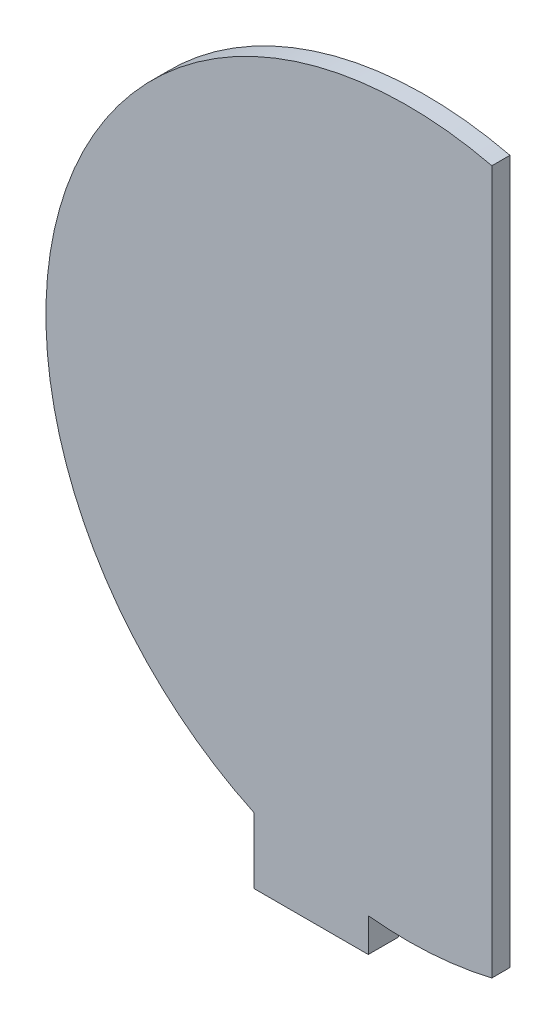
ISO-10303-21;
HEADER;
FILE_DESCRIPTION(('STEP AP214'),'2;1');
FILE_NAME('part.step','',(''),(''),'','','');
FILE_SCHEMA(('AUTOMOTIVE_DESIGN { 1 0 10303 214 1 1 1 1 }'));
ENDSEC;
DATA;
#1=APPLICATION_CONTEXT('core data for automotive mechanical design processes');
#2=APPLICATION_PROTOCOL_DEFINITION('international standard','automotive_design',2000,#1);
#3=PRODUCT_CONTEXT('',#1,'mechanical');
#4=PRODUCT('Part','Part','',(#3));
#5=PRODUCT_RELATED_PRODUCT_CATEGORY('part','',(#4));
#6=PRODUCT_DEFINITION_FORMATION('','',#4);
#7=PRODUCT_DEFINITION_CONTEXT('part definition',#1,'design');
#8=PRODUCT_DEFINITION('design','',#6,#7);
#9=PRODUCT_DEFINITION_SHAPE('','',#8);
#10=(LENGTH_UNIT() NAMED_UNIT(*) SI_UNIT(.MILLI.,.METRE.));
#11=(NAMED_UNIT(*) PLANE_ANGLE_UNIT() SI_UNIT($,.RADIAN.));
#12=(NAMED_UNIT(*) SI_UNIT($,.STERADIAN.) SOLID_ANGLE_UNIT());
#13=UNCERTAINTY_MEASURE_WITH_UNIT(LENGTH_MEASURE(1.E-05),#10,'distance_accuracy_value','');
#14=(GEOMETRIC_REPRESENTATION_CONTEXT(3) GLOBAL_UNCERTAINTY_ASSIGNED_CONTEXT((#13)) GLOBAL_UNIT_ASSIGNED_CONTEXT((#10,
#11,#12)) REPRESENTATION_CONTEXT('',''));
#15=CARTESIAN_POINT('',(0.,0.,0.));
#16=DIRECTION('',(0.,0.,1.));
#17=DIRECTION('',(1.,0.,0.));
#18=AXIS2_PLACEMENT_3D('',#15,#16,#17);
#19=CARTESIAN_POINT('',(-2.56182587296405,15.1062106918239,3.));
#20=DIRECTION('',(0.,0.,-1.));
#21=DIRECTION('',(-1.,0.,0.));
#22=AXIS2_PLACEMENT_3D('',#19,#20,#21);
#23=CYLINDRICAL_SURFACE('',#22,60.);
#24=CARTESIAN_POINT('',(-2.56182587296405,15.1062106918239,0.));
#25=DIRECTION('',(0.,0.,1.));
#26=DIRECTION('',(1.,0.,0.));
#27=AXIS2_PLACEMENT_3D('',#24,#25,#26);
#28=CIRCLE('',#27,60.);
#29=CARTESIAN_POINT('',(11.4193016972997,73.4545446171727,0.));
#30=VERTEX_POINT('',#29);
#31=CARTESIAN_POINT('',(-28.0806983027003,-39.1965254263023,0.));
#32=VERTEX_POINT('',#31);
#33=EDGE_CURVE('E85',#30,#32,#28,.T.);
#34=ORIENTED_EDGE('',*,*,#33,.T.);
#35=DIRECTION('',(0.,0.,-1.));
#36=VECTOR('',#35,1.);
#37=CARTESIAN_POINT('',(-28.0806983027003,-39.1965254263023,3.));
#38=LINE('',#37,#36);
#39=CARTESIAN_POINT('',(-28.0806983027003,-39.1965254263023,3.));
#40=VERTEX_POINT('',#39);
#41=EDGE_CURVE('E97',#32,#40,#38,.F.);
#42=ORIENTED_EDGE('',*,*,#41,.T.);
#43=CARTESIAN_POINT('',(-2.56182587296405,15.1062106918239,3.));
#44=DIRECTION('',(0.,0.,1.));
#45=DIRECTION('',(1.,0.,0.));
#46=AXIS2_PLACEMENT_3D('',#43,#44,#45);
#47=CIRCLE('',#46,60.);
#48=CARTESIAN_POINT('',(11.4193016972997,73.4545446171727,3.));
#49=VERTEX_POINT('',#48);
#50=EDGE_CURVE('E90',#49,#40,#47,.T.);
#51=ORIENTED_EDGE('',*,*,#50,.F.);
#52=DIRECTION('',(0.,0.,-1.));
#53=VECTOR('',#52,1.);
#54=CARTESIAN_POINT('',(11.4193016972997,73.4545446171727,3.));
#55=LINE('',#54,#53);
#56=EDGE_CURVE('E77',#49,#30,#55,.T.);
#57=ORIENTED_EDGE('',*,*,#56,.T.);
#58=EDGE_LOOP('',(#34,#42,#51,#57));
#59=FACE_BOUND('',#58,.T.);
#60=ADVANCED_FACE('F37',(#59),#23,.T.);
#61=CARTESIAN_POINT('',(-9.08069830270029,-44.538607207511,3.));
#62=VERTEX_POINT('',#61);
#63=CARTESIAN_POINT('',(11.4193016972997,-43.2421232335249,3.));
#64=VERTEX_POINT('',#63);
#65=EDGE_CURVE('E84',#62,#64,#47,.T.);
#66=ORIENTED_EDGE('',*,*,#65,.F.);
#67=DIRECTION('',(0.,0.,-1.));
#68=VECTOR('',#67,1.);
#69=CARTESIAN_POINT('',(-9.08069830270029,-44.538607207511,3.));
#70=LINE('',#69,#68);
#71=CARTESIAN_POINT('',(-9.08069830270029,-44.538607207511,0.));
#72=VERTEX_POINT('',#71);
#73=EDGE_CURVE('E124',#62,#72,#70,.T.);
#74=ORIENTED_EDGE('',*,*,#73,.T.);
#75=CARTESIAN_POINT('',(11.4193016972997,-43.2421232335249,0.));
#76=VERTEX_POINT('',#75);
#77=EDGE_CURVE('E95',#72,#76,#28,.T.);
#78=ORIENTED_EDGE('',*,*,#77,.T.);
#79=DIRECTION('',(0.,0.,-1.));
#80=VECTOR('',#79,1.);
#81=CARTESIAN_POINT('',(11.4193016972997,-43.2421232335249,3.));
#82=LINE('',#81,#80);
#83=EDGE_CURVE('E80',#64,#76,#82,.T.);
#84=ORIENTED_EDGE('',*,*,#83,.F.);
#85=EDGE_LOOP('',(#66,#74,#78,#84));
#86=FACE_BOUND('',#85,.T.);
#87=ADVANCED_FACE('F39',(#86),#23,.T.);
#88=CARTESIAN_POINT('',(11.4193016972997,73.4545446171727,3.));
#89=DIRECTION('',(-1.,0.,0.));
#90=DIRECTION('',(0.,0.,1.));
#91=AXIS2_PLACEMENT_3D('',#88,#89,#90);
#92=PLANE('',#91);
#93=DIRECTION('',(0.,1.,0.));
#94=VECTOR('',#93,1.);
#95=CARTESIAN_POINT('',(11.4193016972997,73.4545446171727,0.));
#96=LINE('',#95,#94);
#97=EDGE_CURVE('E74',#76,#30,#96,.T.);
#98=ORIENTED_EDGE('',*,*,#97,.T.);
#99=ORIENTED_EDGE('',*,*,#56,.F.);
#100=DIRECTION('',(0.,1.,0.));
#101=VECTOR('',#100,1.);
#102=CARTESIAN_POINT('',(11.4193016972997,73.4545446171727,3.));
#103=LINE('',#102,#101);
#104=EDGE_CURVE('E61',#64,#49,#103,.T.);
#105=ORIENTED_EDGE('',*,*,#104,.F.);
#106=ORIENTED_EDGE('',*,*,#83,.T.);
#107=EDGE_LOOP('',(#98,#99,#105,#106));
#108=FACE_BOUND('',#107,.T.);
#109=ADVANCED_FACE('F76',(#108),#92,.F.);
#110=CARTESIAN_POINT('',(-2.56182587296405,15.1062106918239,3.));
#111=DIRECTION('',(0.,0.,1.));
#112=DIRECTION('',(1.,0.,0.));
#113=AXIS2_PLACEMENT_3D('',#110,#111,#112);
#114=PLANE('',#113);
#115=ORIENTED_EDGE('',*,*,#50,.T.);
#116=DIRECTION('',(0.,-1.,0.));
#117=VECTOR('',#116,1.);
#118=CARTESIAN_POINT('',(-28.0806983027003,-50.1210917906914,3.));
#119=LINE('',#118,#117);
#120=CARTESIAN_POINT('',(-28.0806983027003,-50.1210917906914,3.));
#121=VERTEX_POINT('',#120);
#122=EDGE_CURVE('E153',#40,#121,#119,.T.);
#123=ORIENTED_EDGE('',*,*,#122,.T.);
#124=DIRECTION('',(1.,0.,0.));
#125=VECTOR('',#124,1.);
#126=CARTESIAN_POINT('',(-28.0806983027003,-50.1210917906914,3.));
#127=LINE('',#126,#125);
#128=CARTESIAN_POINT('',(-9.08069830270029,-50.1210917906914,3.));
#129=VERTEX_POINT('',#128);
#130=EDGE_CURVE('E161',#121,#129,#127,.T.);
#131=ORIENTED_EDGE('',*,*,#130,.T.);
#132=DIRECTION('',(0.,1.,0.));
#133=VECTOR('',#132,1.);
#134=CARTESIAN_POINT('',(-9.08069830270029,-50.1210917906914,3.));
#135=LINE('',#134,#133);
#136=EDGE_CURVE('E142',#129,#62,#135,.T.);
#137=ORIENTED_EDGE('',*,*,#136,.T.);
#138=ORIENTED_EDGE('',*,*,#65,.T.);
#139=ORIENTED_EDGE('',*,*,#104,.T.);
#140=EDGE_LOOP('',(#115,#123,#131,#137,#138,#139));
#141=FACE_BOUND('',#140,.T.);
#142=ADVANCED_FACE('F138',(#141),#114,.T.);
#143=CARTESIAN_POINT('',(-2.56182587296405,15.1062106918239,0.));
#144=DIRECTION('',(0.,0.,1.));
#145=DIRECTION('',(1.,0.,0.));
#146=AXIS2_PLACEMENT_3D('',#143,#144,#145);
#147=PLANE('',#146);
#148=DIRECTION('',(-1.,0.,0.));
#149=VECTOR('',#148,1.);
#150=CARTESIAN_POINT('',(-2.56182587296404,-25.7769929716059,0.));
#151=LINE('',#150,#149);
#152=CARTESIAN_POINT('',(-9.08069830270029,-25.7769929716059,0.));
#153=VERTEX_POINT('',#152);
#154=CARTESIAN_POINT('',(-28.0806983027003,-25.7769929716059,0.));
#155=VERTEX_POINT('',#154);
#156=EDGE_CURVE('E45',#153,#155,#151,.T.);
#157=ORIENTED_EDGE('',*,*,#156,.T.);
#158=DIRECTION('',(0.,-1.,0.));
#159=VECTOR('',#158,1.);
#160=CARTESIAN_POINT('',(-28.0806983027003,15.1062106918239,0.));
#161=LINE('',#160,#159);
#162=EDGE_CURVE('E11',#155,#32,#161,.T.);
#163=ORIENTED_EDGE('',*,*,#162,.T.);
#164=ORIENTED_EDGE('',*,*,#33,.F.);
#165=ORIENTED_EDGE('',*,*,#97,.F.);
#166=ORIENTED_EDGE('',*,*,#77,.F.);
#167=DIRECTION('',(0.,1.,0.));
#168=VECTOR('',#167,1.);
#169=CARTESIAN_POINT('',(-9.0806983027003,15.1062106918239,0.));
#170=LINE('',#169,#168);
#171=EDGE_CURVE('E102',#72,#153,#170,.T.);
#172=ORIENTED_EDGE('',*,*,#171,.T.);
#173=EDGE_LOOP('',(#157,#163,#164,#165,#166,#172));
#174=FACE_BOUND('',#173,.T.);
#175=ADVANCED_FACE('F93',(#174),#147,.F.);
#176=CARTESIAN_POINT('',(-28.0806983027003,-50.1210917906914,-2.));
#177=DIRECTION('',(-1.,0.,0.));
#178=DIRECTION('',(0.,-1.,0.));
#179=AXIS2_PLACEMENT_3D('',#176,#177,#178);
#180=PLANE('',#179);
#181=ORIENTED_EDGE('',*,*,#41,.F.);
#182=ORIENTED_EDGE('',*,*,#162,.F.);
#183=DIRECTION('',(0.,0.,1.));
#184=VECTOR('',#183,1.);
#185=CARTESIAN_POINT('',(-28.0806983027003,-25.7769929716059,-2.));
#186=LINE('',#185,#184);
#187=CARTESIAN_POINT('',(-28.0806983027003,-25.7769929716059,-2.));
#188=VERTEX_POINT('',#187);
#189=EDGE_CURVE('E115',#188,#155,#186,.T.);
#190=ORIENTED_EDGE('',*,*,#189,.F.);
#191=DIRECTION('',(0.,-1.,0.));
#192=VECTOR('',#191,1.);
#193=CARTESIAN_POINT('',(-28.0806983027003,-50.1210917906914,-2.));
#194=LINE('',#193,#192);
#195=CARTESIAN_POINT('',(-28.0806983027003,-50.1210917906914,-2.));
#196=VERTEX_POINT('',#195);
#197=EDGE_CURVE('E132',#188,#196,#194,.T.);
#198=ORIENTED_EDGE('',*,*,#197,.T.);
#199=DIRECTION('',(0.,0.,1.));
#200=VECTOR('',#199,1.);
#201=CARTESIAN_POINT('',(-28.0806983027003,-50.1210917906914,-2.));
#202=LINE('',#201,#200);
#203=EDGE_CURVE('E121',#196,#121,#202,.T.);
#204=ORIENTED_EDGE('',*,*,#203,.T.);
#205=ORIENTED_EDGE('',*,*,#122,.F.);
#206=EDGE_LOOP('',(#181,#182,#190,#198,#204,#205));
#207=FACE_BOUND('',#206,.T.);
#208=ADVANCED_FACE('F152',(#207),#180,.T.);
#209=CARTESIAN_POINT('',(-28.0806983027003,-25.7769929716059,-2.));
#210=DIRECTION('',(0.,1.,0.));
#211=DIRECTION('',(-1.,0.,0.));
#212=AXIS2_PLACEMENT_3D('',#209,#210,#211);
#213=PLANE('',#212);
#214=ORIENTED_EDGE('',*,*,#156,.F.);
#215=DIRECTION('',(0.,0.,1.));
#216=VECTOR('',#215,1.);
#217=CARTESIAN_POINT('',(-9.08069830270029,-25.7769929716059,-2.));
#218=LINE('',#217,#216);
#219=CARTESIAN_POINT('',(-9.08069830270029,-25.7769929716059,-2.));
#220=VERTEX_POINT('',#219);
#221=EDGE_CURVE('E52',#220,#153,#218,.T.);
#222=ORIENTED_EDGE('',*,*,#221,.F.);
#223=DIRECTION('',(-1.,0.,0.));
#224=VECTOR('',#223,1.);
#225=CARTESIAN_POINT('',(-28.0806983027003,-25.7769929716059,-2.));
#226=LINE('',#225,#224);
#227=EDGE_CURVE('E117',#220,#188,#226,.T.);
#228=ORIENTED_EDGE('',*,*,#227,.T.);
#229=ORIENTED_EDGE('',*,*,#189,.T.);
#230=EDGE_LOOP('',(#214,#222,#228,#229));
#231=FACE_BOUND('',#230,.T.);
#232=ADVANCED_FACE('F110',(#231),#213,.T.);
#233=CARTESIAN_POINT('',(-9.08069830270029,-50.1210917906914,-2.));
#234=DIRECTION('',(1.,0.,0.));
#235=DIRECTION('',(0.,1.,0.));
#236=AXIS2_PLACEMENT_3D('',#233,#234,#235);
#237=PLANE('',#236);
#238=ORIENTED_EDGE('',*,*,#73,.F.);
#239=ORIENTED_EDGE('',*,*,#136,.F.);
#240=DIRECTION('',(0.,0.,1.));
#241=VECTOR('',#240,1.);
#242=CARTESIAN_POINT('',(-9.08069830270029,-50.1210917906914,-2.));
#243=LINE('',#242,#241);
#244=CARTESIAN_POINT('',(-9.08069830270029,-50.1210917906914,-2.));
#245=VERTEX_POINT('',#244);
#246=EDGE_CURVE('E126',#245,#129,#243,.T.);
#247=ORIENTED_EDGE('',*,*,#246,.F.);
#248=DIRECTION('',(0.,1.,0.));
#249=VECTOR('',#248,1.);
#250=CARTESIAN_POINT('',(-9.08069830270029,-50.1210917906914,-2.));
#251=LINE('',#250,#249);
#252=EDGE_CURVE('E159',#245,#220,#251,.T.);
#253=ORIENTED_EDGE('',*,*,#252,.T.);
#254=ORIENTED_EDGE('',*,*,#221,.T.);
#255=ORIENTED_EDGE('',*,*,#171,.F.);
#256=EDGE_LOOP('',(#238,#239,#247,#253,#254,#255));
#257=FACE_BOUND('',#256,.T.);
#258=ADVANCED_FACE('F169',(#257),#237,.T.);
#259=CARTESIAN_POINT('',(-28.0806983027003,-50.1210917906914,-2.));
#260=DIRECTION('',(0.,-1.,0.));
#261=DIRECTION('',(1.,0.,0.));
#262=AXIS2_PLACEMENT_3D('',#259,#260,#261);
#263=PLANE('',#262);
#264=ORIENTED_EDGE('',*,*,#130,.F.);
#265=ORIENTED_EDGE('',*,*,#203,.F.);
#266=DIRECTION('',(1.,0.,0.));
#267=VECTOR('',#266,1.);
#268=CARTESIAN_POINT('',(-28.0806983027003,-50.1210917906914,-2.));
#269=LINE('',#268,#267);
#270=EDGE_CURVE('E157',#196,#245,#269,.T.);
#271=ORIENTED_EDGE('',*,*,#270,.T.);
#272=ORIENTED_EDGE('',*,*,#246,.T.);
#273=EDGE_LOOP('',(#264,#265,#271,#272));
#274=FACE_BOUND('',#273,.T.);
#275=ADVANCED_FACE('F177',(#274),#263,.T.);
#276=CARTESIAN_POINT('',(0.,0.,-2.));
#277=DIRECTION('',(0.,0.,1.));
#278=DIRECTION('',(1.,0.,0.));
#279=AXIS2_PLACEMENT_3D('',#276,#277,#278);
#280=PLANE('',#279);
#281=ORIENTED_EDGE('',*,*,#270,.F.);
#282=ORIENTED_EDGE('',*,*,#197,.F.);
#283=ORIENTED_EDGE('',*,*,#227,.F.);
#284=ORIENTED_EDGE('',*,*,#252,.F.);
#285=EDGE_LOOP('',(#281,#282,#283,#284));
#286=FACE_BOUND('',#285,.T.);
#287=ADVANCED_FACE('F174',(#286),#280,.F.);
#288=CLOSED_SHELL('',(#60,#87,#109,#142,#175,#208,#232,#258,#275,#287));
#289=MANIFOLD_SOLID_BREP('B2',#288);
#290=ADVANCED_BREP_SHAPE_REPRESENTATION('',(#18,#289),#14);
#291=SHAPE_DEFINITION_REPRESENTATION(#9,#290);
ENDSEC;
END-ISO-10303-21;
